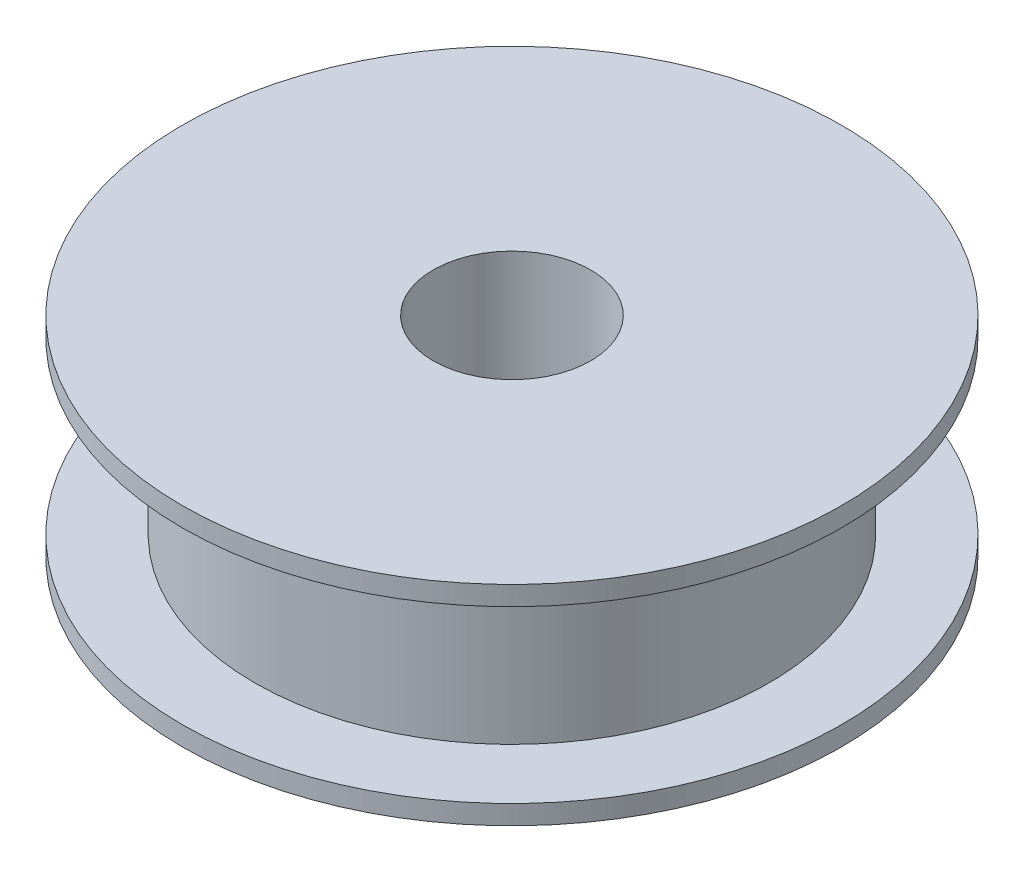
ISO-10303-21;
HEADER;
FILE_DESCRIPTION(('STEP AP214'),'2;1');
FILE_NAME('part.step','',(''),(''),'','','');
FILE_SCHEMA(('AUTOMOTIVE_DESIGN { 1 0 10303 214 1 1 1 1 }'));
ENDSEC;
DATA;
#1=APPLICATION_CONTEXT('core data for automotive mechanical design processes');
#2=APPLICATION_PROTOCOL_DEFINITION('international standard','automotive_design',2000,#1);
#3=PRODUCT_CONTEXT('',#1,'mechanical');
#4=PRODUCT('Part','Part','',(#3));
#5=PRODUCT_RELATED_PRODUCT_CATEGORY('part','',(#4));
#6=PRODUCT_DEFINITION_FORMATION('','',#4);
#7=PRODUCT_DEFINITION_CONTEXT('part definition',#1,'design');
#8=PRODUCT_DEFINITION('design','',#6,#7);
#9=PRODUCT_DEFINITION_SHAPE('','',#8);
#10=(LENGTH_UNIT() NAMED_UNIT(*) SI_UNIT(.MILLI.,.METRE.));
#11=(NAMED_UNIT(*) PLANE_ANGLE_UNIT() SI_UNIT($,.RADIAN.));
#12=(NAMED_UNIT(*) SI_UNIT($,.STERADIAN.) SOLID_ANGLE_UNIT());
#13=UNCERTAINTY_MEASURE_WITH_UNIT(LENGTH_MEASURE(1.E-05),#10,'distance_accuracy_value','');
#14=(GEOMETRIC_REPRESENTATION_CONTEXT(3) GLOBAL_UNCERTAINTY_ASSIGNED_CONTEXT((#13)) GLOBAL_UNIT_ASSIGNED_CONTEXT((#10,
#11,#12)) REPRESENTATION_CONTEXT('',''));
#15=CARTESIAN_POINT('',(0.,0.,0.));
#16=DIRECTION('',(0.,0.,1.));
#17=DIRECTION('',(1.,0.,0.));
#18=AXIS2_PLACEMENT_3D('',#15,#16,#17);
#19=CARTESIAN_POINT('',(0.,29.9892782236334,0.));
#20=DIRECTION('',(0.,1.,0.));
#21=DIRECTION('',(0.,0.,1.));
#22=AXIS2_PLACEMENT_3D('',#19,#20,#21);
#23=CYLINDRICAL_SURFACE('',#22,24.5);
#24=CARTESIAN_POINT('',(0.,0.,0.));
#25=DIRECTION('',(0.,1.,0.));
#26=DIRECTION('',(0.,0.,1.));
#27=AXIS2_PLACEMENT_3D('',#24,#25,#26);
#28=CIRCLE('',#27,24.5);
#29=CARTESIAN_POINT('',(0.,0.,24.5));
#30=VERTEX_POINT('',#29);
#31=EDGE_CURVE('E59',#30,#30,#28,.T.);
#32=ORIENTED_EDGE('',*,*,#31,.F.);
#33=EDGE_LOOP('',(#32));
#34=FACE_BOUND('',#33,.T.);
#35=CARTESIAN_POINT('',(0.,65.,0.));
#36=DIRECTION('',(0.,1.,0.));
#37=DIRECTION('',(0.,0.,1.));
#38=AXIS2_PLACEMENT_3D('',#35,#36,#37);
#39=CIRCLE('',#38,24.5);
#40=CARTESIAN_POINT('',(0.,65.,24.5));
#41=VERTEX_POINT('',#40);
#42=EDGE_CURVE('E10',#41,#41,#39,.T.);
#43=ORIENTED_EDGE('',*,*,#42,.T.);
#44=EDGE_LOOP('',(#43));
#45=FACE_BOUND('',#44,.T.);
#46=ADVANCED_FACE('F31',(#34,#45),#23,.F.);
#47=CARTESIAN_POINT('',(24.5,65.,0.));
#48=DIRECTION('',(0.,-1.,0.));
#49=DIRECTION('',(0.,0.,-1.));
#50=AXIS2_PLACEMENT_3D('',#47,#48,#49);
#51=PLANE('',#50);
#52=ORIENTED_EDGE('',*,*,#42,.F.);
#53=EDGE_LOOP('',(#52));
#54=FACE_BOUND('',#53,.T.);
#55=CARTESIAN_POINT('',(0.,65.,0.));
#56=DIRECTION('',(0.,1.,0.));
#57=DIRECTION('',(0.,0.,1.));
#58=AXIS2_PLACEMENT_3D('',#55,#56,#57);
#59=CIRCLE('',#58,102.5);
#60=CARTESIAN_POINT('',(0.,65.,102.5));
#61=VERTEX_POINT('',#60);
#62=EDGE_CURVE('E37',#61,#61,#59,.T.);
#63=ORIENTED_EDGE('',*,*,#62,.T.);
#64=EDGE_LOOP('',(#63));
#65=FACE_BOUND('',#64,.T.);
#66=ADVANCED_FACE('F66',(#54,#65),#51,.F.);
#67=CARTESIAN_POINT('',(0.,29.9892782236334,0.));
#68=DIRECTION('',(0.,1.,0.));
#69=DIRECTION('',(0.,0.,1.));
#70=AXIS2_PLACEMENT_3D('',#67,#68,#69);
#71=CYLINDRICAL_SURFACE('',#70,102.5);
#72=ORIENTED_EDGE('',*,*,#62,.F.);
#73=EDGE_LOOP('',(#72));
#74=FACE_BOUND('',#73,.T.);
#75=CARTESIAN_POINT('',(0.,59.,0.));
#76=DIRECTION('',(0.,1.,0.));
#77=DIRECTION('',(0.,0.,1.));
#78=AXIS2_PLACEMENT_3D('',#75,#76,#77);
#79=CIRCLE('',#78,102.5);
#80=CARTESIAN_POINT('',(0.,59.,102.5));
#81=VERTEX_POINT('',#80);
#82=EDGE_CURVE('E41',#81,#81,#79,.T.);
#83=ORIENTED_EDGE('',*,*,#82,.T.);
#84=EDGE_LOOP('',(#83));
#85=FACE_BOUND('',#84,.T.);
#86=ADVANCED_FACE('F70',(#74,#85),#71,.T.);
#87=CARTESIAN_POINT('',(102.5,59.,0.));
#88=DIRECTION('',(0.,1.,0.));
#89=DIRECTION('',(0.,0.,1.));
#90=AXIS2_PLACEMENT_3D('',#87,#88,#89);
#91=PLANE('',#90);
#92=ORIENTED_EDGE('',*,*,#82,.F.);
#93=EDGE_LOOP('',(#92));
#94=FACE_BOUND('',#93,.T.);
#95=CARTESIAN_POINT('',(0.,59.,0.));
#96=DIRECTION('',(0.,1.,0.));
#97=DIRECTION('',(0.,0.,1.));
#98=AXIS2_PLACEMENT_3D('',#95,#96,#97);
#99=CIRCLE('',#98,80.);
#100=CARTESIAN_POINT('',(0.,59.,80.));
#101=VERTEX_POINT('',#100);
#102=EDGE_CURVE('E45',#101,#101,#99,.T.);
#103=ORIENTED_EDGE('',*,*,#102,.T.);
#104=EDGE_LOOP('',(#103));
#105=FACE_BOUND('',#104,.T.);
#106=ADVANCED_FACE('F75',(#94,#105),#91,.F.);
#107=CARTESIAN_POINT('',(0.,29.9892782236334,0.));
#108=DIRECTION('',(0.,1.,0.));
#109=DIRECTION('',(0.,0.,1.));
#110=AXIS2_PLACEMENT_3D('',#107,#108,#109);
#111=CYLINDRICAL_SURFACE('',#110,80.);
#112=ORIENTED_EDGE('',*,*,#102,.F.);
#113=EDGE_LOOP('',(#112));
#114=FACE_BOUND('',#113,.T.);
#115=CARTESIAN_POINT('',(0.,6.,0.));
#116=DIRECTION('',(0.,1.,0.));
#117=DIRECTION('',(0.,0.,1.));
#118=AXIS2_PLACEMENT_3D('',#115,#116,#117);
#119=CIRCLE('',#118,80.);
#120=CARTESIAN_POINT('',(0.,6.,80.));
#121=VERTEX_POINT('',#120);
#122=EDGE_CURVE('E50',#121,#121,#119,.T.);
#123=ORIENTED_EDGE('',*,*,#122,.T.);
#124=EDGE_LOOP('',(#123));
#125=FACE_BOUND('',#124,.T.);
#126=ADVANCED_FACE('F81',(#114,#125),#111,.T.);
#127=CARTESIAN_POINT('',(102.5,6.,0.));
#128=DIRECTION('',(0.,-1.,0.));
#129=DIRECTION('',(0.,0.,-1.));
#130=AXIS2_PLACEMENT_3D('',#127,#128,#129);
#131=PLANE('',#130);
#132=ORIENTED_EDGE('',*,*,#122,.F.);
#133=EDGE_LOOP('',(#132));
#134=FACE_BOUND('',#133,.T.);
#135=CARTESIAN_POINT('',(0.,6.,0.));
#136=DIRECTION('',(0.,1.,0.));
#137=DIRECTION('',(0.,0.,1.));
#138=AXIS2_PLACEMENT_3D('',#135,#136,#137);
#139=CIRCLE('',#138,102.5);
#140=CARTESIAN_POINT('',(0.,6.,102.5));
#141=VERTEX_POINT('',#140);
#142=EDGE_CURVE('E53',#141,#141,#139,.T.);
#143=ORIENTED_EDGE('',*,*,#142,.T.);
#144=EDGE_LOOP('',(#143));
#145=FACE_BOUND('',#144,.T.);
#146=ADVANCED_FACE('F85',(#134,#145),#131,.F.);
#147=CARTESIAN_POINT('',(0.,29.9892782236334,0.));
#148=DIRECTION('',(0.,1.,0.));
#149=DIRECTION('',(0.,0.,1.));
#150=AXIS2_PLACEMENT_3D('',#147,#148,#149);
#151=CYLINDRICAL_SURFACE('',#150,102.5);
#152=ORIENTED_EDGE('',*,*,#142,.F.);
#153=EDGE_LOOP('',(#152));
#154=FACE_BOUND('',#153,.T.);
#155=CARTESIAN_POINT('',(0.,0.,0.));
#156=DIRECTION('',(0.,1.,0.));
#157=DIRECTION('',(0.,0.,1.));
#158=AXIS2_PLACEMENT_3D('',#155,#156,#157);
#159=CIRCLE('',#158,102.5);
#160=CARTESIAN_POINT('',(0.,0.,102.5));
#161=VERTEX_POINT('',#160);
#162=EDGE_CURVE('E56',#161,#161,#159,.T.);
#163=ORIENTED_EDGE('',*,*,#162,.T.);
#164=EDGE_LOOP('',(#163));
#165=FACE_BOUND('',#164,.T.);
#166=ADVANCED_FACE('F89',(#154,#165),#151,.T.);
#167=CARTESIAN_POINT('',(24.5,0.,0.));
#168=DIRECTION('',(0.,1.,0.));
#169=DIRECTION('',(0.,0.,1.));
#170=AXIS2_PLACEMENT_3D('',#167,#168,#169);
#171=PLANE('',#170);
#172=ORIENTED_EDGE('',*,*,#162,.F.);
#173=EDGE_LOOP('',(#172));
#174=FACE_BOUND('',#173,.T.);
#175=ORIENTED_EDGE('',*,*,#31,.T.);
#176=EDGE_LOOP('',(#175));
#177=FACE_BOUND('',#176,.T.);
#178=ADVANCED_FACE('F63',(#174,#177),#171,.F.);
#179=CLOSED_SHELL('',(#46,#66,#86,#106,#126,#146,#166,#178));
#180=MANIFOLD_SOLID_BREP('B2',#179);
#181=ADVANCED_BREP_SHAPE_REPRESENTATION('',(#18,#180),#14);
#182=SHAPE_DEFINITION_REPRESENTATION(#9,#181);
ENDSEC;
END-ISO-10303-21;
